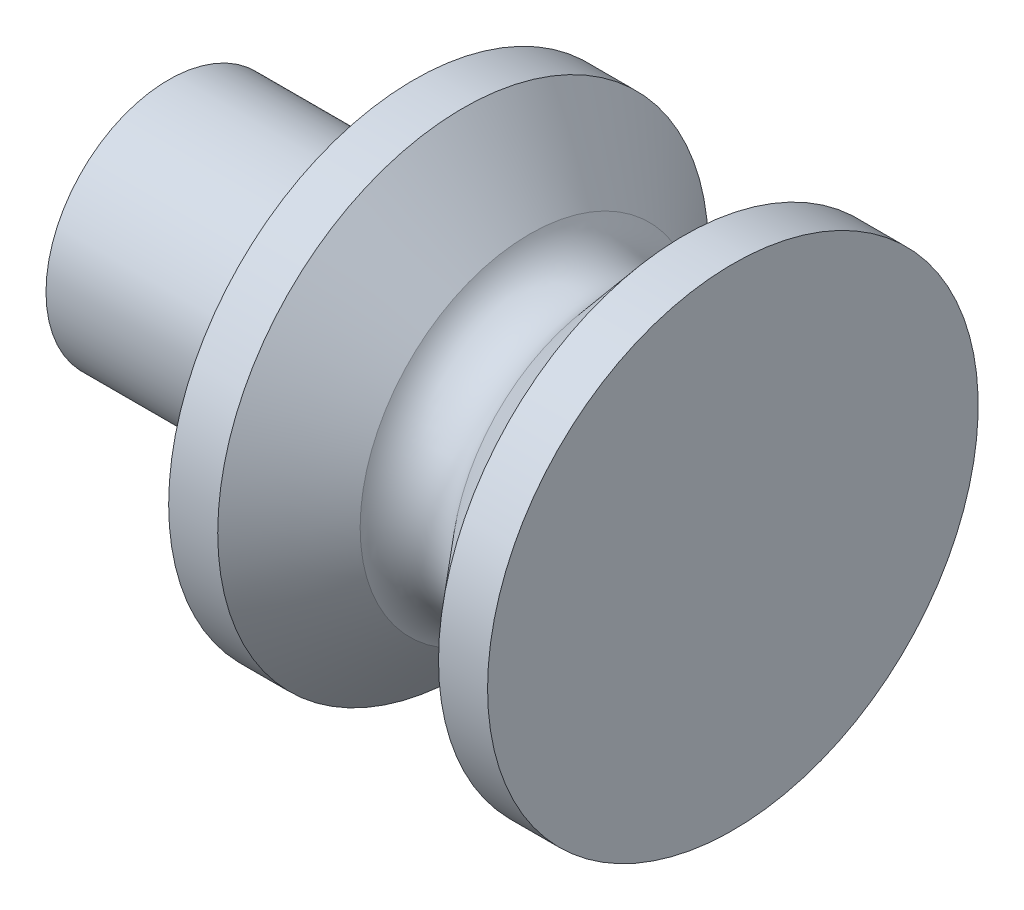
ISO-10303-21;
HEADER;
FILE_DESCRIPTION(('STEP AP214'),'2;1');
FILE_NAME('part.step','',(''),(''),'','','');
FILE_SCHEMA(('AUTOMOTIVE_DESIGN { 1 0 10303 214 1 1 1 1 }'));
ENDSEC;
DATA;
#1=APPLICATION_CONTEXT('core data for automotive mechanical design processes');
#2=APPLICATION_PROTOCOL_DEFINITION('international standard','automotive_design',2000,#1);
#3=PRODUCT_CONTEXT('',#1,'mechanical');
#4=PRODUCT('Part','Part','',(#3));
#5=PRODUCT_RELATED_PRODUCT_CATEGORY('part','',(#4));
#6=PRODUCT_DEFINITION_FORMATION('','',#4);
#7=PRODUCT_DEFINITION_CONTEXT('part definition',#1,'design');
#8=PRODUCT_DEFINITION('design','',#6,#7);
#9=PRODUCT_DEFINITION_SHAPE('','',#8);
#10=(LENGTH_UNIT() NAMED_UNIT(*) SI_UNIT(.MILLI.,.METRE.));
#11=(NAMED_UNIT(*) PLANE_ANGLE_UNIT() SI_UNIT($,.RADIAN.));
#12=(NAMED_UNIT(*) SI_UNIT($,.STERADIAN.) SOLID_ANGLE_UNIT());
#13=UNCERTAINTY_MEASURE_WITH_UNIT(LENGTH_MEASURE(1.E-05),#10,'distance_accuracy_value','');
#14=(GEOMETRIC_REPRESENTATION_CONTEXT(3) GLOBAL_UNCERTAINTY_ASSIGNED_CONTEXT((#13)) GLOBAL_UNIT_ASSIGNED_CONTEXT((#10,
#11,#12)) REPRESENTATION_CONTEXT('',''));
#15=CARTESIAN_POINT('',(0.,0.,0.));
#16=DIRECTION('',(0.,0.,1.));
#17=DIRECTION('',(1.,0.,0.));
#18=AXIS2_PLACEMENT_3D('',#15,#16,#17);
#19=CARTESIAN_POINT('',(14.6028024720552,8.58950517302747,0.));
#20=DIRECTION('',(-1.,0.,0.));
#21=DIRECTION('',(0.,0.,1.));
#22=AXIS2_PLACEMENT_3D('',#19,#20,#21);
#23=PLANE('',#22);
#24=CARTESIAN_POINT('',(14.6028024720552,8.58950517302747,0.));
#25=DIRECTION('',(-1.,0.,0.));
#26=DIRECTION('',(0.,0.,1.));
#27=AXIS2_PLACEMENT_3D('',#24,#25,#26);
#28=CIRCLE('',#27,5.);
#29=CARTESIAN_POINT('',(14.6028024720552,8.58950517302747,5.));
#30=VERTEX_POINT('',#29);
#31=EDGE_CURVE('E83',#30,#30,#28,.T.);
#32=ORIENTED_EDGE('',*,*,#31,.F.);
#33=EDGE_LOOP('',(#32));
#34=FACE_BOUND('',#33,.T.);
#35=ADVANCED_FACE('F28',(#34),#23,.F.);
#36=CARTESIAN_POINT('',(8.10280247205517,8.58950517302747,0.));
#37=DIRECTION('',(1.,0.,0.));
#38=DIRECTION('',(0.,0.,-1.));
#39=AXIS2_PLACEMENT_3D('',#36,#37,#38);
#40=PLANE('',#39);
#41=CARTESIAN_POINT('',(8.10280247205517,8.58950517302747,0.));
#42=DIRECTION('',(-1.,0.,0.));
#43=DIRECTION('',(0.,0.,1.));
#44=AXIS2_PLACEMENT_3D('',#41,#42,#43);
#45=CIRCLE('',#44,1.);
#46=CARTESIAN_POINT('',(8.10280247205517,8.58950517302747,1.));
#47=VERTEX_POINT('',#46);
#48=EDGE_CURVE('E10',#47,#47,#45,.T.);
#49=ORIENTED_EDGE('',*,*,#48,.T.);
#50=EDGE_LOOP('',(#49));
#51=FACE_BOUND('',#50,.T.);
#52=ADVANCED_FACE('F75',(#51),#40,.F.);
#53=CARTESIAN_POINT('',(8.10280247205517,8.58950517302747,0.));
#54=DIRECTION('',(-1.,0.,0.));
#55=DIRECTION('',(0.,0.,1.));
#56=AXIS2_PLACEMENT_3D('',#53,#54,#55);
#57=CYLINDRICAL_SURFACE('',#56,1.);
#58=ORIENTED_EDGE('',*,*,#48,.F.);
#59=EDGE_LOOP('',(#58));
#60=FACE_BOUND('',#59,.T.);
#61=CARTESIAN_POINT('',(3.10280247205517,8.58950517302747,0.));
#62=DIRECTION('',(-1.,0.,0.));
#63=DIRECTION('',(0.,0.,1.));
#64=AXIS2_PLACEMENT_3D('',#61,#62,#63);
#65=CIRCLE('',#64,1.);
#66=CARTESIAN_POINT('',(3.10280247205517,8.58950517302747,1.));
#67=VERTEX_POINT('',#66);
#68=EDGE_CURVE('E39',#67,#67,#65,.T.);
#69=ORIENTED_EDGE('',*,*,#68,.T.);
#70=EDGE_LOOP('',(#69));
#71=FACE_BOUND('',#70,.T.);
#72=ADVANCED_FACE('F80',(#60,#71),#57,.F.);
#73=CARTESIAN_POINT('',(3.10280247205517,9.58950517302747,0.));
#74=DIRECTION('',(1.,0.,0.));
#75=DIRECTION('',(0.,0.,-1.));
#76=AXIS2_PLACEMENT_3D('',#73,#74,#75);
#77=PLANE('',#76);
#78=ORIENTED_EDGE('',*,*,#68,.F.);
#79=EDGE_LOOP('',(#78));
#80=FACE_BOUND('',#79,.T.);
#81=CARTESIAN_POINT('',(3.10280247205517,8.58950517302747,0.));
#82=DIRECTION('',(-1.,0.,0.));
#83=DIRECTION('',(0.,0.,1.));
#84=AXIS2_PLACEMENT_3D('',#81,#82,#83);
#85=CIRCLE('',#84,2.5);
#86=CARTESIAN_POINT('',(3.10280247205517,8.58950517302747,2.5));
#87=VERTEX_POINT('',#86);
#88=EDGE_CURVE('E44',#87,#87,#85,.T.);
#89=ORIENTED_EDGE('',*,*,#88,.T.);
#90=EDGE_LOOP('',(#89));
#91=FACE_BOUND('',#90,.T.);
#92=ADVANCED_FACE('F108',(#80,#91),#77,.F.);
#93=CARTESIAN_POINT('',(8.10280247205517,8.58950517302747,0.));
#94=DIRECTION('',(-1.,0.,0.));
#95=DIRECTION('',(0.,0.,1.));
#96=AXIS2_PLACEMENT_3D('',#93,#94,#95);
#97=CYLINDRICAL_SURFACE('',#96,2.5);
#98=ORIENTED_EDGE('',*,*,#88,.F.);
#99=EDGE_LOOP('',(#98));
#100=FACE_BOUND('',#99,.T.);
#101=CARTESIAN_POINT('',(8.10280247205517,8.58950517302747,0.));
#102=DIRECTION('',(-1.,0.,0.));
#103=DIRECTION('',(0.,0.,1.));
#104=AXIS2_PLACEMENT_3D('',#101,#102,#103);
#105=CIRCLE('',#104,2.5);
#106=CARTESIAN_POINT('',(8.10280247205517,8.58950517302747,2.5));
#107=VERTEX_POINT('',#106);
#108=EDGE_CURVE('E103',#107,#107,#105,.T.);
#109=ORIENTED_EDGE('',*,*,#108,.T.);
#110=EDGE_LOOP('',(#109));
#111=FACE_BOUND('',#110,.T.);
#112=ADVANCED_FACE('F110',(#100,#111),#97,.T.);
#113=CARTESIAN_POINT('',(8.10280247205517,11.0895051730275,0.));
#114=DIRECTION('',(1.,0.,0.));
#115=DIRECTION('',(0.,0.,-1.));
#116=AXIS2_PLACEMENT_3D('',#113,#114,#115);
#117=PLANE('',#116);
#118=ORIENTED_EDGE('',*,*,#108,.F.);
#119=EDGE_LOOP('',(#118));
#120=FACE_BOUND('',#119,.T.);
#121=CARTESIAN_POINT('',(8.10280247205517,8.58950517302747,0.));
#122=DIRECTION('',(-1.,0.,0.));
#123=DIRECTION('',(0.,0.,1.));
#124=AXIS2_PLACEMENT_3D('',#121,#122,#123);
#125=CIRCLE('',#124,5.);
#126=CARTESIAN_POINT('',(8.10280247205517,8.58950517302747,5.));
#127=VERTEX_POINT('',#126);
#128=EDGE_CURVE('E100',#127,#127,#125,.T.);
#129=ORIENTED_EDGE('',*,*,#128,.T.);
#130=EDGE_LOOP('',(#129));
#131=FACE_BOUND('',#130,.T.);
#132=ADVANCED_FACE('F113',(#120,#131),#117,.F.);
#133=CARTESIAN_POINT('',(8.10280247205517,8.58950517302747,0.));
#134=DIRECTION('',(-1.,0.,0.));
#135=DIRECTION('',(0.,0.,1.));
#136=AXIS2_PLACEMENT_3D('',#133,#134,#135);
#137=CYLINDRICAL_SURFACE('',#136,5.);
#138=ORIENTED_EDGE('',*,*,#128,.F.);
#139=EDGE_LOOP('',(#138));
#140=FACE_BOUND('',#139,.T.);
#141=CARTESIAN_POINT('',(9.10280247205517,8.58950517302747,0.));
#142=DIRECTION('',(-1.,0.,0.));
#143=DIRECTION('',(0.,0.,1.));
#144=AXIS2_PLACEMENT_3D('',#141,#142,#143);
#145=CIRCLE('',#144,5.);
#146=CARTESIAN_POINT('',(9.10280247205517,8.58950517302747,5.));
#147=VERTEX_POINT('',#146);
#148=EDGE_CURVE('E97',#147,#147,#145,.T.);
#149=ORIENTED_EDGE('',*,*,#148,.T.);
#150=EDGE_LOOP('',(#149));
#151=FACE_BOUND('',#150,.T.);
#152=ADVANCED_FACE('F119',(#140,#151),#137,.T.);
#153=CARTESIAN_POINT('',(10.4583752810553,8.58950517302747,0.));
#154=DIRECTION('',(-1.,0.,0.));
#155=DIRECTION('',(0.,0.,1.));
#156=AXIS2_PLACEMENT_3D('',#153,#154,#155);
#157=CONICAL_SURFACE('',#156,3.45278640450004,0.851322092346766);
#158=ORIENTED_EDGE('',*,*,#148,.F.);
#159=EDGE_LOOP('',(#158));
#160=FACE_BOUND('',#159,.T.);
#161=CARTESIAN_POINT('',(10.4583752810553,8.58950517302747,0.));
#162=DIRECTION('',(-1.,0.,0.));
#163=DIRECTION('',(0.,0.,1.));
#164=AXIS2_PLACEMENT_3D('',#161,#162,#163);
#165=CIRCLE('',#164,3.45278640450004);
#166=CARTESIAN_POINT('',(10.4583752810553,8.58950517302747,3.45278640450004));
#167=VERTEX_POINT('',#166);
#168=EDGE_CURVE('E94',#167,#167,#165,.T.);
#169=ORIENTED_EDGE('',*,*,#168,.T.);
#170=EDGE_LOOP('',(#169));
#171=FACE_BOUND('',#170,.T.);
#172=ADVANCED_FACE('F70',(#160,#171),#157,.T.);
#173=CARTESIAN_POINT('',(11.3528024720552,8.58950517302747,0.));
#174=DIRECTION('',(-1.,0.,0.));
#175=DIRECTION('',(0.,0.,1.));
#176=AXIS2_PLACEMENT_3D('',#173,#174,#175);
#177=TOROIDAL_SURFACE('',#176,3.9,0.999999999999998);
#178=CARTESIAN_POINT('',(11.3518527777152,8.58918872585574,-2.89999940672968));
#179=CARTESIAN_POINT('',(11.3518702731971,8.58913541006978,-2.89999912600179));
#180=CARTESIAN_POINT('',(11.3518934109214,8.58908392644896,-2.90000003794534));
#181=CARTESIAN_POINT('',(11.3519470039869,8.58898491357615,-2.9000006648174));
#182=CARTESIAN_POINT('',(11.3519774759496,8.58893739364122,-2.90000037700239));
#183=CARTESIAN_POINT('',(11.3520462269307,8.58884833987515,-2.90000011888035));
#184=CARTESIAN_POINT('',(11.3520844988283,8.5888068006426,-2.90000014828497));
#185=CARTESIAN_POINT('',(11.3521673580077,8.58873074029296,-2.90000012240513));
#186=CARTESIAN_POINT('',(11.3522119388371,8.58869621209224,-2.90000006720664));
#187=CARTESIAN_POINT('',(11.3523062985892,8.58863512574279,-2.89999998500082));
#188=CARTESIAN_POINT('',(11.3523560792815,8.58860857031939,-2.89999995800313));
#189=CARTESIAN_POINT('',(11.3524594063292,8.58856418076495,-2.89999990670916));
#190=CARTESIAN_POINT('',(11.3525129541275,8.5885463499963,-2.89999988241392));
#191=CARTESIAN_POINT('',(11.3526222777004,8.58851993577574,-2.89999984693576));
#192=CARTESIAN_POINT('',(11.3526780531798,8.58851135110184,-2.8999998357511));
#193=CARTESIAN_POINT('',(11.3527902464839,8.58850366833941,-2.89999982569885));
#194=CARTESIAN_POINT('',(11.3528466642297,8.58850456909589,-2.89999982682976));
#195=CARTESIAN_POINT('',(11.3529585503705,8.58851582928565,-2.89999984182733));
#196=CARTESIAN_POINT('',(11.3530140187242,8.58852618912796,-2.89999985569456));
#197=CARTESIAN_POINT('',(11.353122430742,8.58855607444514,-2.89999989445562));
#198=CARTESIAN_POINT('',(11.3531753743202,8.58857560023105,-2.89999991934983));
#199=CARTESIAN_POINT('',(11.3532772312082,8.58862326296937,-2.89999997739731));
#200=CARTESIAN_POINT('',(11.3533261445683,8.58865139981434,-2.90000001055048));
#201=CARTESIAN_POINT('',(11.3534185528492,8.58871548574549,-2.90000008136738));
#202=CARTESIAN_POINT('',(11.3534620478156,8.58875143476596,-2.90000011903107));
#203=CARTESIAN_POINT('',(11.353542385275,8.58883012487867,-2.90000019462597));
#204=CARTESIAN_POINT('',(11.3535792277407,8.58887286599876,-2.90000023255717));
#205=CARTESIAN_POINT('',(11.3536452141961,8.5889639269937,-2.90000030440981));
#206=CARTESIAN_POINT('',(11.3536743581717,8.58901224687869,-2.90000033833123));
#207=CARTESIAN_POINT('',(11.3537241202231,8.58911309364944,-2.90000039834001));
#208=CARTESIAN_POINT('',(11.3537447383045,8.58916562053233,-2.90000042442737));
#209=CARTESIAN_POINT('',(11.3537768633069,8.58927339022397,-2.90000046582684));
#210=CARTESIAN_POINT('',(11.3537883702308,8.58932863303186,-2.90000048113894));
#211=CARTESIAN_POINT('',(11.3538019462695,8.58944026637234,-2.90000049926161));
#212=CARTESIAN_POINT('',(11.3538040153901,8.58949665690422,-2.90000050207218));
#213=CARTESIAN_POINT('',(11.3537986571072,8.58960898496433,-2.90000049487488));
#214=CARTESIAN_POINT('',(11.3537912297036,8.58966492249255,-2.90000048486702));
#215=CARTESIAN_POINT('',(11.353767089215,8.58977475661581,-2.90000045316122));
#216=CARTESIAN_POINT('',(11.3537503761342,8.58982865321176,-2.9000004314633));
#217=CARTESIAN_POINT('',(11.3537081387352,8.58993287553827,-2.9000003788236));
#218=CARTESIAN_POINT('',(11.3536826144165,8.58998320126862,-2.90000034788184));
#219=CARTESIAN_POINT('',(11.3536234790766,8.59007885329605,-2.90000028024293));
#220=CARTESIAN_POINT('',(11.3535898680499,8.59012417958968,-2.90000024354579));
#221=CARTESIAN_POINT('',(11.3535155134343,8.59020854602004,-2.90000016853344));
#222=CARTESIAN_POINT('',(11.3534747698473,8.59024758615832,-2.90000013021823));
#223=CARTESIAN_POINT('',(11.3533873066774,8.59031827206464,-2.90000005628951));
#224=CARTESIAN_POINT('',(11.3533405870932,8.59034991783087,-2.900000020676));
#225=CARTESIAN_POINT('',(11.3532424981144,8.59040491668602,-2.89999995616575));
#226=CARTESIAN_POINT('',(11.3531911287147,8.59042826976585,-2.89999992726902));
#227=CARTESIAN_POINT('',(11.3530851983045,8.59046602029083,-2.89999987945034));
#228=CARTESIAN_POINT('',(11.3530306372898,8.59048041772436,-2.8999998605284));
#229=CARTESIAN_POINT('',(11.3529198727842,8.59049984816772,-2.89999983479244));
#230=CARTESIAN_POINT('',(11.3528636693004,8.59050488121772,-2.89999982797838));
#231=CARTESIAN_POINT('',(11.3527512154268,8.59050544013609,-2.89999982722726));
#232=CARTESIAN_POINT('',(11.3526949650374,8.59050096606267,-2.89999983329012));
#233=CARTESIAN_POINT('',(11.3525840129321,8.59048263772378,-2.8999998576056));
#234=CARTESIAN_POINT('',(11.3525293112394,8.59046878331819,-2.89999987585839));
#235=CARTESIAN_POINT('',(11.3524230094478,8.59043208718236,-2.89999992251038));
#236=CARTESIAN_POINT('',(11.3523714093962,8.59040924531509,-2.89999995090972));
#237=CARTESIAN_POINT('',(11.3522727788333,8.59035522392175,-2.90000001459911));
#238=CARTESIAN_POINT('',(11.3522257481141,8.59032404477534,-2.90000004988885));
#239=CARTESIAN_POINT('',(11.3521375901813,8.59025423463668,-2.90000012357513));
#240=CARTESIAN_POINT('',(11.3520964627741,8.59021560388899,-2.90000016197158));
#241=CARTESIAN_POINT('',(11.3520212720413,8.59013198130426,-2.90000023682046));
#242=CARTESIAN_POINT('',(11.3519872095125,8.59008698875068,-2.90000027327266));
#243=CARTESIAN_POINT('',(11.3519271232575,8.58999192330962,-2.90000034283527));
#244=CARTESIAN_POINT('',(11.3519010997235,8.58994185030067,-2.90000037594559));
#245=CARTESIAN_POINT('',(11.3518578254001,8.58983805010551,-2.90000042494858));
#246=CARTESIAN_POINT('',(11.35184057321,8.58978432350433,-2.90000044084399));
#247=CARTESIAN_POINT('',(11.3518153564951,8.58967473498866,-2.90000049146602));
#248=CARTESIAN_POINT('',(11.3518073947715,8.58961887243542,-2.90000052619832));
#249=CARTESIAN_POINT('',(11.3518008640402,8.58950657256136,-2.90000046936241));
#250=CARTESIAN_POINT('',(11.3518022908622,8.58945013550684,-2.9000003778503));
#251=CARTESIAN_POINT('',(11.351812600683,8.58935943362743,-2.90000056293127));
#252=CARTESIAN_POINT('',(11.3518184880123,8.58932478821105,-2.90000071439045));
#253=CARTESIAN_POINT('',(11.3518331091618,8.58925609876093,-2.90000022376205));
#254=CARTESIAN_POINT('',(11.3518418410338,8.58922205433233,-2.89999958221679));
#255=CARTESIAN_POINT('',(11.3518527777152,8.58918872585574,-2.89999940672968));
#256=B_SPLINE_CURVE_WITH_KNOTS('',3,(#178,#179,#180,#181,#182,#183,#184,#185,#186,#187,#188,
#189,#190,#191,#192,#193,#194,#195,#196,#197,#198,#199,#200,#201,#202,#203,#204,#205,#206,#207,
#208,#209,#210,#211,#212,#213,#214,#215,#216,#217,#218,#219,#220,#221,#222,#223,#224,#225,#226,
#227,#228,#229,#230,#231,#232,#233,#234,#235,#236,#237,#238,#239,#240,#241,#242,#243,#244,#245,
#246,#247,#248,#249,#250,#251,#252,#253,#254,#255),.UNSPECIFIED.,.T.,.F.,(4,2,2,2,2,2,2,2,2,2,2,
2,2,2,2,2,2,2,2,2,2,2,2,2,2,2,2,2,2,2,2,2,2,2,2,2,2,2,4),(0.,0.000168334105441601,
0.000337053358078564,0.000505619264877217,0.000674014003366703,0.000842466238931,
0.00101098334298288,0.00117947817268692,0.00134795248610109,0.00151643408475516,
0.00168492140088405,0.00185340661496362,0.00202189041195729,0.00219037489946832,
0.00235885969364388,0.00252734437281437,0.00269582899785175,0.00286431351784141,
0.00303279804133058,0.00320128248970998,0.0033697669478212,0.00353825152218553,
0.00370673605489628,0.00387522062875669,0.00404370538702628,0.00421219036366909,
0.00438067461737486,0.00454915783933755,0.00471764357798854,0.00488613188555317,
0.00505461252195447,0.00522308762989317,0.00539158172834658,0.00556007985600608,
0.00572855106659568,0.0058970730594615,0.00606552020025587,0.00617082028098221,
0.00627604838916466),.UNSPECIFIED.);
#257=CARTESIAN_POINT('',(11.3518527777152,8.58918872585574,-2.89999940672968));
#258=VERTEX_POINT('',#257);
#259=EDGE_CURVE('E31',#258,#258,#256,.T.);
#260=ORIENTED_EDGE('',*,*,#259,.T.);
#261=EDGE_LOOP('',(#260));
#262=FACE_BOUND('',#261,.T.);
#263=CARTESIAN_POINT('',(11.3518538862753,8.58918865285645,2.90000043263432));
#264=CARTESIAN_POINT('',(11.3518361095665,8.5892419361078,2.90000045530652));
#265=CARTESIAN_POINT('',(11.3518228196523,8.58929675943208,2.9000004728648));
#266=CARTESIAN_POINT('',(11.3518056228163,8.58940790496953,2.90000049571984));
#267=CARTESIAN_POINT('',(11.3518017272142,8.58946422890838,2.90000050100179));
#268=CARTESIAN_POINT('',(11.351803450878,8.58957670941087,2.90000049868379));
#269=CARTESIAN_POINT('',(11.3518090656035,8.58963286604157,2.90000049108999));
#270=CARTESIAN_POINT('',(11.3518296422624,8.5897434240406,2.9000004638871));
#271=CARTESIAN_POINT('',(11.3518446018728,8.58979782584161,2.900000444281));
#272=CARTESIAN_POINT('',(11.3518834428866,8.58990335220344,2.90000039526483));
#273=CARTESIAN_POINT('',(11.3519073252192,8.58995447642229,2.90000036585372));
#274=CARTESIAN_POINT('',(11.3519633349054,8.59005199164173,2.90000030054209));
#275=CARTESIAN_POINT('',(11.3519954625827,8.5900983824564,2.90000026464131));
#276=CARTESIAN_POINT('',(11.3520670497636,8.59018511098413,2.90000019039958));
#277=CARTESIAN_POINT('',(11.3521065091365,8.59022544880511,2.90000015205869));
#278=CARTESIAN_POINT('',(11.3521916398782,8.59029892716298,2.90000007725882));
#279=CARTESIAN_POINT('',(11.3522373112346,8.59033206771432,2.90000004079985));
#280=CARTESIAN_POINT('',(11.3523335696416,8.59039021094435,2.89999997387417));
#281=CARTESIAN_POINT('',(11.352384156703,8.59041521360481,2.89999994340748));
#282=CARTESIAN_POINT('',(11.3524888103179,8.59045637116144,2.89999989190139));
#283=CARTESIAN_POINT('',(11.3525428768649,8.59047252607359,2.89999987086198));
#284=CARTESIAN_POINT('',(11.3526529547304,8.59049552960282,2.89999984058241));
#285=CARTESIAN_POINT('',(11.3527089660484,8.59050237822241,2.89999983134225));
#286=CARTESIAN_POINT('',(11.3528213435317,8.59050657476909,2.89999982570294));
#287=CARTESIAN_POINT('',(11.3528777096975,8.59050392268618,2.8999998293038));
#288=CARTESIAN_POINT('',(11.3529891966912,8.59048919309232,2.89999984894056));
#289=CARTESIAN_POINT('',(11.3530443175202,8.59047711559025,2.89999986497646));
#290=CARTESIAN_POINT('',(11.3531517491577,8.59044387802772,2.89999990767536));
#291=CARTESIAN_POINT('',(11.3532040599671,8.59042271797091,2.89999993433836));
#292=CARTESIAN_POINT('',(11.3533043866669,8.59037191595363,2.89999999528542));
#293=CARTESIAN_POINT('',(11.353352402555,8.59034227398881,2.9000000295695));
#294=CARTESIAN_POINT('',(11.3534427763657,8.59027534960786,2.90000010189346));
#295=CARTESIAN_POINT('',(11.3534851342875,8.59023806719069,2.90000013993334));
#296=CARTESIAN_POINT('',(11.3535629897701,8.59015692020841,2.90000021548024));
#297=CARTESIAN_POINT('',(11.3535984873258,8.59011305563844,2.90000025298726));
#298=CARTESIAN_POINT('',(11.3536616143699,8.5900199895604,2.90000032323976));
#299=CARTESIAN_POINT('',(11.3536892438586,8.58997078805256,2.90000035598524));
#300=CARTESIAN_POINT('',(11.3537358504438,8.58986844478016,2.90000041302288));
#301=CARTESIAN_POINT('',(11.3537548275406,8.58981530301572,2.90000043731504));
#302=CARTESIAN_POINT('',(11.3537835906428,8.58970658776725,2.90000047470724));
#303=CARTESIAN_POINT('',(11.3537933766479,8.58965101428312,2.90000048780729));
#304=CARTESIAN_POINT('',(11.353803479758,8.5895390132092,2.90000050133836));
#305=CARTESIAN_POINT('',(11.3538037968701,8.58948258562005,2.9000005017694));
#306=CARTESIAN_POINT('',(11.3537949532169,8.58937047811746,2.90000048991385));
#307=CARTESIAN_POINT('',(11.3537857924528,8.58931479820393,2.90000047762727));
#308=CARTESIAN_POINT('',(11.3537582530982,8.58920576666003,2.90000044172174));
#309=CARTESIAN_POINT('',(11.3537398745118,8.58915241502861,2.9000004181028));
#310=CARTESIAN_POINT('',(11.3536944212262,8.58904955449142,2.90000036219538));
#311=CARTESIAN_POINT('',(11.3536673465234,8.58900004558723,2.90000032990689));
#312=CARTESIAN_POINT('',(11.3536052695424,8.5889062758933,2.90000026030064));
#313=CARTESIAN_POINT('',(11.3535702672565,8.5888620151087,2.90000022298288));
#314=CARTESIAN_POINT('',(11.3534933287809,8.5887799981813,2.90000014752542));
#315=CARTESIAN_POINT('',(11.3534513925985,8.58874224203164,2.90000010938572));
#316=CARTESIAN_POINT('',(11.3533617767301,8.58867430609572,2.90000003658431));
#317=CARTESIAN_POINT('',(11.3533140970426,8.5886441263112,2.9000000019226));
#318=CARTESIAN_POINT('',(11.3532143475661,8.58859219978061,2.89999993998495));
#319=CARTESIAN_POINT('',(11.3531622777691,8.58857045304972,2.89999991270902));
#320=CARTESIAN_POINT('',(11.353055226381,8.58853601007559,2.89999986861824));
#321=CARTESIAN_POINT('',(11.3530002447966,8.58852331381158,2.89999985180336));
#322=CARTESIAN_POINT('',(11.3528889303737,8.58850733208815,2.8999998305303));
#323=CARTESIAN_POINT('',(11.3528325975325,8.5885040466476,2.89999982607214));
#324=CARTESIAN_POINT('',(11.3527201788394,8.58850697988834,2.89999983001525));
#325=CARTESIAN_POINT('',(11.3526640929918,8.58851319873928,2.89999983841674));
#326=CARTESIAN_POINT('',(11.3525537635864,8.58853496403104,2.89999986713182));
#327=CARTESIAN_POINT('',(11.3524995199563,8.58855051010564,2.89999988744495));
#328=CARTESIAN_POINT('',(11.3523944181674,8.5885904856614,2.89999993768999));
#329=CARTESIAN_POINT('',(11.3523435596552,8.58861491421333,2.89999996762091));
#330=CARTESIAN_POINT('',(11.3522466523452,8.58867197057286,2.90000003373747));
#331=CARTESIAN_POINT('',(11.3522006047461,8.58870460041686,2.90000006992468));
#332=CARTESIAN_POINT('',(11.3521146236434,8.5887771405964,2.90000014448313));
#333=CARTESIAN_POINT('',(11.3520746930749,8.58881705440674,2.90000018285543));
#334=CARTESIAN_POINT('',(11.3520021397716,8.58890299091655,2.90000025740189));
#335=CARTESIAN_POINT('',(11.351969508304,8.58894900620974,2.90000029357866));
#336=CARTESIAN_POINT('',(11.3519231590626,8.5890276336306,2.90000034727744));
#337=CARTESIAN_POINT('',(11.3519069379744,8.58905879906892,2.90000036670683));
#338=CARTESIAN_POINT('',(11.3518778559723,8.58912266015321,2.90000040230127));
#339=CARTESIAN_POINT('',(11.3518649950585,8.5891553557992,2.90000041846631));
#340=CARTESIAN_POINT('',(11.3518538862753,8.58918865285645,2.90000043263432));
#341=B_SPLINE_CURVE_WITH_KNOTS('',3,(#263,#264,#265,#266,#267,#268,#269,#270,#271,#272,#273,
#274,#275,#276,#277,#278,#279,#280,#281,#282,#283,#284,#285,#286,#287,#288,#289,#290,#291,#292,
#293,#294,#295,#296,#297,#298,#299,#300,#301,#302,#303,#304,#305,#306,#307,#308,#309,#310,#311,
#312,#313,#314,#315,#316,#317,#318,#319,#320,#321,#322,#323,#324,#325,#326,#327,#328,#329,#330,
#331,#332,#333,#334,#335,#336,#337,#338,#339,#340),.UNSPECIFIED.,.T.,.F.,(4,2,2,2,2,2,2,2,2,2,2,
2,2,2,2,2,2,2,2,2,2,2,2,2,2,2,2,2,2,2,2,2,2,2,2,2,2,2,4),(0.,0.000168383158652728,
0.000336969111687019,0.000505474603619362,0.000673938225119455,0.00084241939479607,
0.00101090717988282,0.00117939196029805,0.00134787640237733,0.00151636122182429,
0.00168484573690731,0.00185333020632271,0.00202181485289272,0.00219029934076864,
0.00235878376089175,0.00252726826704987,0.00269575279612475,0.00286423744948407,
0.00303272209520141,0.0032012067357061,0.00336969138288366,0.00353817590348828,
0.00370666040171966,0.00387514482333557,0.00404362931391423,0.00421211396961111,
0.00438059844813944,0.0045490829657424,0.00471756778648177,0.0048860522204916,
0.0050545369924117,0.00522302477167683,0.00539150593608834,0.00555996948060019,
0.00572847489702081,0.00589706091007433,0.00606544412737263,0.00617066788003445,
0.00627589163295662),.UNSPECIFIED.);
#342=CARTESIAN_POINT('',(11.3518538862753,8.58918865285645,2.90000043263432));
#343=VERTEX_POINT('',#342);
#344=EDGE_CURVE('E47',#343,#343,#341,.T.);
#345=ORIENTED_EDGE('',*,*,#344,.T.);
#346=EDGE_LOOP('',(#345));
#347=FACE_BOUND('',#346,.T.);
#348=ORIENTED_EDGE('',*,*,#168,.F.);
#349=EDGE_LOOP('',(#348));
#350=FACE_BOUND('',#349,.T.);
#351=CARTESIAN_POINT('',(12.1141913521995,8.58950517302747,0.));
#352=DIRECTION('',(-1.,0.,0.));
#353=DIRECTION('',(0.,0.,1.));
#354=AXIS2_PLACEMENT_3D('',#351,#352,#353);
#355=CIRCLE('',#354,3.25170456334121);
#356=CARTESIAN_POINT('',(12.1141913521995,8.58950517302747,3.25170456334121));
#357=VERTEX_POINT('',#356);
#358=EDGE_CURVE('E88',#357,#357,#355,.T.);
#359=ORIENTED_EDGE('',*,*,#358,.T.);
#360=EDGE_LOOP('',(#359));
#361=FACE_BOUND('',#360,.T.);
#362=ADVANCED_FACE('F51',(#262,#347,#350,#361),#177,.F.);
#363=CARTESIAN_POINT('',(13.6028024720552,8.58950517302747,0.));
#364=DIRECTION('',(1.,0.,0.));
#365=DIRECTION('',(0.,0.,-1.));
#366=AXIS2_PLACEMENT_3D('',#363,#364,#365);
#367=CONICAL_SURFACE('',#366,5.,0.86545278503991);
#368=ORIENTED_EDGE('',*,*,#358,.F.);
#369=EDGE_LOOP('',(#368));
#370=FACE_BOUND('',#369,.T.);
#371=CARTESIAN_POINT('',(13.6028024720552,8.58950517302747,0.));
#372=DIRECTION('',(-1.,0.,0.));
#373=DIRECTION('',(0.,0.,1.));
#374=AXIS2_PLACEMENT_3D('',#371,#372,#373);
#375=CIRCLE('',#374,5.);
#376=CARTESIAN_POINT('',(13.6028024720552,8.58950517302747,5.));
#377=VERTEX_POINT('',#376);
#378=EDGE_CURVE('E85',#377,#377,#375,.T.);
#379=ORIENTED_EDGE('',*,*,#378,.T.);
#380=EDGE_LOOP('',(#379));
#381=FACE_BOUND('',#380,.T.);
#382=ADVANCED_FACE('F63',(#370,#381),#367,.T.);
#383=CARTESIAN_POINT('',(8.10280247205517,8.58950517302747,0.));
#384=DIRECTION('',(-1.,0.,0.));
#385=DIRECTION('',(0.,0.,1.));
#386=AXIS2_PLACEMENT_3D('',#383,#384,#385);
#387=CYLINDRICAL_SURFACE('',#386,5.);
#388=ORIENTED_EDGE('',*,*,#378,.F.);
#389=EDGE_LOOP('',(#388));
#390=FACE_BOUND('',#389,.T.);
#391=ORIENTED_EDGE('',*,*,#31,.T.);
#392=EDGE_LOOP('',(#391));
#393=FACE_BOUND('',#392,.T.);
#394=ADVANCED_FACE('F59',(#390,#393),#387,.T.);
#395=CARTESIAN_POINT('',(11.3528024720552,8.58950517302747,-35.));
#396=DIRECTION('',(0.,0.,1.));
#397=DIRECTION('',(1.,0.,0.));
#398=AXIS2_PLACEMENT_3D('',#395,#396,#397);
#399=CYLINDRICAL_SURFACE('',#398,0.000999999999998835);
#400=ORIENTED_EDGE('',*,*,#344,.F.);
#401=EDGE_LOOP('',(#400));
#402=FACE_BOUND('',#401,.T.);
#403=ORIENTED_EDGE('',*,*,#259,.F.);
#404=EDGE_LOOP('',(#403));
#405=FACE_BOUND('',#404,.T.);
#406=ADVANCED_FACE('F55',(#402,#405),#399,.F.);
#407=CLOSED_SHELL('',(#35,#52,#72,#92,#112,#132,#152,#172,#362,#382,#394,#406));
#408=MANIFOLD_SOLID_BREP('B2',#407);
#409=ADVANCED_BREP_SHAPE_REPRESENTATION('',(#18,#408),#14);
#410=SHAPE_DEFINITION_REPRESENTATION(#9,#409);
ENDSEC;
END-ISO-10303-21;
